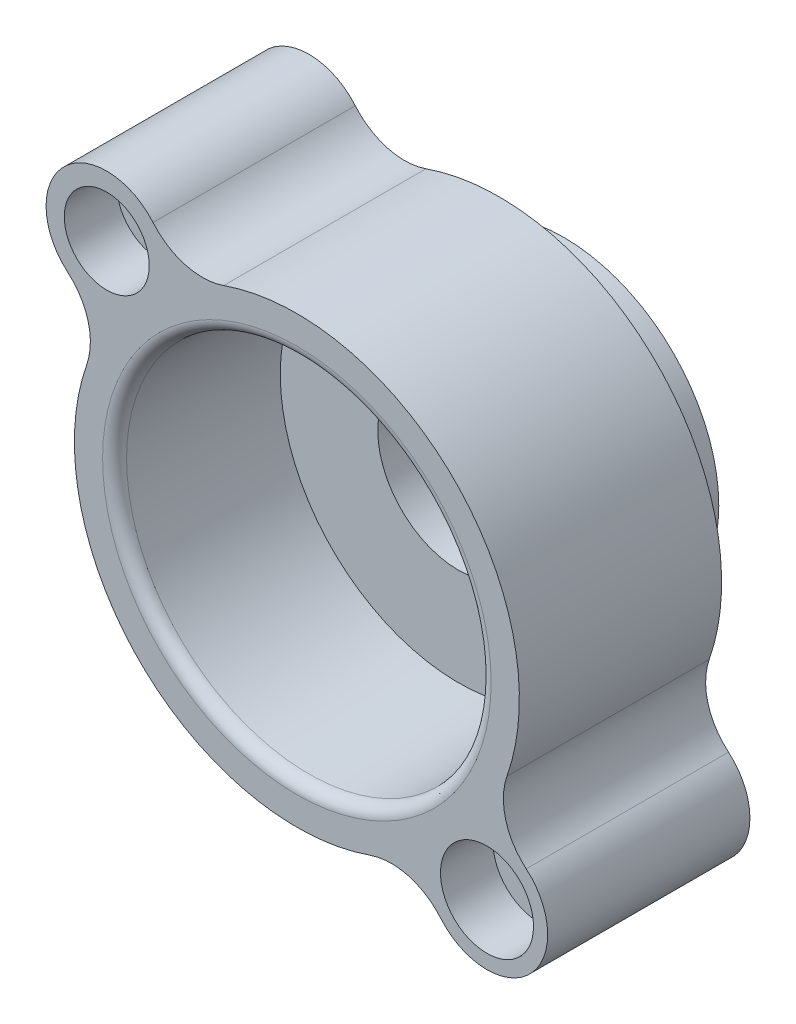
ISO-10303-21;
HEADER;
FILE_DESCRIPTION(('STEP AP214'),'2;1');
FILE_NAME('part.step','',(''),(''),'','','');
FILE_SCHEMA(('AUTOMOTIVE_DESIGN { 1 0 10303 214 1 1 1 1 }'));
ENDSEC;
DATA;
#1=APPLICATION_CONTEXT('core data for automotive mechanical design processes');
#2=APPLICATION_PROTOCOL_DEFINITION('international standard','automotive_design',2000,#1);
#3=PRODUCT_CONTEXT('',#1,'mechanical');
#4=PRODUCT('Part','Part','',(#3));
#5=PRODUCT_RELATED_PRODUCT_CATEGORY('part','',(#4));
#6=PRODUCT_DEFINITION_FORMATION('','',#4);
#7=PRODUCT_DEFINITION_CONTEXT('part definition',#1,'design');
#8=PRODUCT_DEFINITION('design','',#6,#7);
#9=PRODUCT_DEFINITION_SHAPE('','',#8);
#10=(LENGTH_UNIT() NAMED_UNIT(*) SI_UNIT(.MILLI.,.METRE.));
#11=(NAMED_UNIT(*) PLANE_ANGLE_UNIT() SI_UNIT($,.RADIAN.));
#12=(NAMED_UNIT(*) SI_UNIT($,.STERADIAN.) SOLID_ANGLE_UNIT());
#13=UNCERTAINTY_MEASURE_WITH_UNIT(LENGTH_MEASURE(1.E-05),#10,'distance_accuracy_value','');
#14=(GEOMETRIC_REPRESENTATION_CONTEXT(3) GLOBAL_UNCERTAINTY_ASSIGNED_CONTEXT((#13)) GLOBAL_UNIT_ASSIGNED_CONTEXT((#10,
#11,#12)) REPRESENTATION_CONTEXT('',''));
#15=CARTESIAN_POINT('',(0.,0.,0.));
#16=DIRECTION('',(0.,0.,1.));
#17=DIRECTION('',(1.,0.,0.));
#18=AXIS2_PLACEMENT_3D('',#15,#16,#17);
#19=CARTESIAN_POINT('',(-148.308512816503,425.758508459999,203.2));
#20=DIRECTION('',(0.,0.,1.));
#21=DIRECTION('',(1.,0.,0.));
#22=AXIS2_PLACEMENT_3D('',#19,#20,#21);
#23=PLANE('',#22);
#24=CARTESIAN_POINT('',(-596.9,596.9,203.2));
#25=DIRECTION('',(0.,0.,1.));
#26=DIRECTION('',(1.,0.,0.));
#27=AXIS2_PLACEMENT_3D('',#24,#25,#26);
#28=CIRCLE('',#27,69.85);
#29=CARTESIAN_POINT('',(-527.05,596.9,203.2));
#30=VERTEX_POINT('',#29);
#31=EDGE_CURVE('E176',#30,#30,#28,.T.);
#32=ORIENTED_EDGE('',*,*,#31,.T.);
#33=EDGE_LOOP('',(#32));
#34=FACE_BOUND('',#33,.T.);
#35=CARTESIAN_POINT('',(596.9,-596.9,203.2));
#36=DIRECTION('',(0.,0.,1.));
#37=DIRECTION('',(1.,0.,0.));
#38=AXIS2_PLACEMENT_3D('',#35,#36,#37);
#39=CIRCLE('',#38,69.85);
#40=CARTESIAN_POINT('',(666.75,-596.9,203.2));
#41=VERTEX_POINT('',#40);
#42=EDGE_CURVE('E171',#41,#41,#39,.T.);
#43=ORIENTED_EDGE('',*,*,#42,.T.);
#44=EDGE_LOOP('',(#43));
#45=FACE_BOUND('',#44,.T.);
#46=CARTESIAN_POINT('',(-1.57651669496772E-11,-8.62643290133747E-11,203.2));
#47=DIRECTION('',(0.,0.,1.));
#48=DIRECTION('',(1.,0.,0.));
#49=AXIS2_PLACEMENT_3D('',#46,#47,#48);
#50=CIRCLE('',#49,698.499999999974);
#51=CARTESIAN_POINT('',(659.625858177572,-229.773752250957,203.2));
#52=VERTEX_POINT('',#51);
#53=CARTESIAN_POINT('',(-229.773752250906,659.625858177495,203.2));
#54=VERTEX_POINT('',#53);
#55=EDGE_CURVE('E157',#52,#54,#50,.T.);
#56=ORIENTED_EDGE('',*,*,#55,.F.);
#57=CARTESIAN_POINT('',(851.517016920151,-296.617025633031,203.2));
#58=DIRECTION('',(0.,0.,-1.));
#59=DIRECTION('',(-1.,0.,0.));
#60=AXIS2_PLACEMENT_3D('',#57,#58,#59);
#61=CIRCLE('',#60,203.200000000001);
#62=CARTESIAN_POINT('',(720.101782380515,-451.601786596465,203.2));
#63=VERTEX_POINT('',#62);
#64=EDGE_CURVE('E125',#63,#52,#61,.T.);
#65=ORIENTED_EDGE('',*,*,#64,.F.);
#66=CARTESIAN_POINT('',(596.899999999598,-596.899999999694,203.2));
#67=DIRECTION('',(0.,0.,1.));
#68=DIRECTION('',(1.,0.,0.));
#69=AXIS2_PLACEMENT_3D('',#66,#67,#68);
#70=CIRCLE('',#69,190.500000000014);
#71=CARTESIAN_POINT('',(451.601786596373,-720.101782380616,203.2));
#72=VERTEX_POINT('',#71);
#73=EDGE_CURVE('E110',#72,#63,#70,.T.);
#74=ORIENTED_EDGE('',*,*,#73,.F.);
#75=CARTESIAN_POINT('',(296.617025632933,-851.517016920266,203.2));
#76=DIRECTION('',(0.,0.,-1.));
#77=DIRECTION('',(-1.,0.,0.));
#78=AXIS2_PLACEMENT_3D('',#75,#76,#77);
#79=CIRCLE('',#78,203.200000000014);
#80=CARTESIAN_POINT('',(229.773752250855,-659.625858177674,203.2));
#81=VERTEX_POINT('',#80);
#82=EDGE_CURVE('E123',#81,#72,#79,.T.);
#83=ORIENTED_EDGE('',*,*,#82,.F.);
#84=CARTESIAN_POINT('',(-1.57651669496772E-11,-8.62643290133747E-11,203.2));
#85=DIRECTION('',(0.,0.,1.));
#86=DIRECTION('',(1.,0.,0.));
#87=AXIS2_PLACEMENT_3D('',#84,#85,#86);
#88=CIRCLE('',#87,698.499999999974);
#89=CARTESIAN_POINT('',(-659.625858177582,229.773752250848,203.2));
#90=VERTEX_POINT('',#89);
#91=EDGE_CURVE('E128',#90,#81,#88,.T.);
#92=ORIENTED_EDGE('',*,*,#91,.F.);
#93=CARTESIAN_POINT('',(-851.517016920142,296.617025632936,203.2));
#94=DIRECTION('',(0.,0.,-1.));
#95=DIRECTION('',(-1.,0.,0.));
#96=AXIS2_PLACEMENT_3D('',#93,#94,#95);
#97=CIRCLE('',#96,203.199999999988);
#98=CARTESIAN_POINT('',(-720.10178238074,451.601786596551,203.2));
#99=VERTEX_POINT('',#98);
#100=EDGE_CURVE('E130',#99,#90,#97,.T.);
#101=ORIENTED_EDGE('',*,*,#100,.F.);
#102=CARTESIAN_POINT('',(-596.900000000034,596.89999999996,203.2));
#103=DIRECTION('',(0.,0.,1.));
#104=DIRECTION('',(1.,0.,0.));
#105=AXIS2_PLACEMENT_3D('',#102,#103,#104);
#106=CIRCLE('',#105,190.500000000014);
#107=CARTESIAN_POINT('',(-451.601786596626,720.101782380665,203.2));
#108=VERTEX_POINT('',#107);
#109=EDGE_CURVE('E239',#108,#99,#106,.T.);
#110=ORIENTED_EDGE('',*,*,#109,.F.);
#111=CARTESIAN_POINT('',(-296.61702563299,851.517016920085,203.2));
#112=DIRECTION('',(0.,0.,-1.));
#113=DIRECTION('',(-1.,0.,0.));
#114=AXIS2_PLACEMENT_3D('',#111,#112,#113);
#115=CIRCLE('',#114,203.200000000014);
#116=EDGE_CURVE('E237',#54,#108,#115,.T.);
#117=ORIENTED_EDGE('',*,*,#116,.F.);
#118=EDGE_LOOP('',(#56,#65,#74,#83,#92,#101,#110,#117));
#119=FACE_BOUND('',#118,.T.);
#120=CARTESIAN_POINT('',(0.,0.,203.2));
#121=DIRECTION('',(0.,0.,1.));
#122=DIRECTION('',(1.,0.,0.));
#123=AXIS2_PLACEMENT_3D('',#120,#121,#122);
#124=CIRCLE('',#123,486.41);
#125=CARTESIAN_POINT('',(486.41,0.,203.2));
#126=VERTEX_POINT('',#125);
#127=EDGE_CURVE('E159',#126,#126,#124,.F.);
#128=ORIENTED_EDGE('',*,*,#127,.F.);
#129=EDGE_LOOP('',(#128));
#130=FACE_BOUND('',#129,.T.);
#131=ADVANCED_FACE('F35',(#34,#45,#119,#130),#23,.F.);
#132=CARTESIAN_POINT('',(-1.57651669496772E-11,-8.62643290133747E-11,203.2));
#133=DIRECTION('',(0.,0.,1.));
#134=DIRECTION('',(1.,0.,0.));
#135=AXIS2_PLACEMENT_3D('',#132,#133,#134);
#136=CYLINDRICAL_SURFACE('',#135,698.499999999974);
#137=CARTESIAN_POINT('',(-1.57651669496772E-11,-8.62643290133747E-11,838.2));
#138=DIRECTION('',(0.,0.,1.));
#139=DIRECTION('',(1.,0.,0.));
#140=AXIS2_PLACEMENT_3D('',#137,#138,#139);
#141=CIRCLE('',#140,698.499999999974);
#142=CARTESIAN_POINT('',(659.625858177572,-229.773752250957,838.2));
#143=VERTEX_POINT('',#142);
#144=CARTESIAN_POINT('',(-229.773752250906,659.625858177495,838.2));
#145=VERTEX_POINT('',#144);
#146=EDGE_CURVE('E135',#143,#145,#141,.T.);
#147=ORIENTED_EDGE('',*,*,#146,.F.);
#148=DIRECTION('',(0.,0.,1.));
#149=VECTOR('',#148,1.);
#150=CARTESIAN_POINT('',(659.625858177572,-229.773752250957,203.2));
#151=LINE('',#150,#149);
#152=EDGE_CURVE('E52',#52,#143,#151,.T.);
#153=ORIENTED_EDGE('',*,*,#152,.F.);
#154=ORIENTED_EDGE('',*,*,#55,.T.);
#155=DIRECTION('',(0.,0.,1.));
#156=VECTOR('',#155,1.);
#157=CARTESIAN_POINT('',(-229.773752250906,659.625858177495,203.2));
#158=LINE('',#157,#156);
#159=EDGE_CURVE('E93',#54,#145,#158,.T.);
#160=ORIENTED_EDGE('',*,*,#159,.T.);
#161=EDGE_LOOP('',(#147,#153,#154,#160));
#162=FACE_BOUND('',#161,.T.);
#163=ADVANCED_FACE('F197',(#162),#136,.T.);
#164=CARTESIAN_POINT('',(851.517016920151,-296.617025633031,203.2));
#165=DIRECTION('',(0.,0.,1.));
#166=DIRECTION('',(1.,0.,0.));
#167=AXIS2_PLACEMENT_3D('',#164,#165,#166);
#168=CYLINDRICAL_SURFACE('',#167,203.200000000001);
#169=CARTESIAN_POINT('',(851.517016920151,-296.617025633031,838.2));
#170=DIRECTION('',(0.,0.,-1.));
#171=DIRECTION('',(-1.,0.,0.));
#172=AXIS2_PLACEMENT_3D('',#169,#170,#171);
#173=CIRCLE('',#172,203.200000000001);
#174=CARTESIAN_POINT('',(720.101782380515,-451.601786596465,838.2));
#175=VERTEX_POINT('',#174);
#176=EDGE_CURVE('E154',#175,#143,#173,.T.);
#177=ORIENTED_EDGE('',*,*,#176,.F.);
#178=DIRECTION('',(0.,0.,1.));
#179=VECTOR('',#178,1.);
#180=CARTESIAN_POINT('',(720.101782380515,-451.601786596465,203.2));
#181=LINE('',#180,#179);
#182=EDGE_CURVE('E81',#63,#175,#181,.T.);
#183=ORIENTED_EDGE('',*,*,#182,.F.);
#184=ORIENTED_EDGE('',*,*,#64,.T.);
#185=ORIENTED_EDGE('',*,*,#152,.T.);
#186=EDGE_LOOP('',(#177,#183,#184,#185));
#187=FACE_BOUND('',#186,.T.);
#188=ADVANCED_FACE('F203',(#187),#168,.F.);
#189=CARTESIAN_POINT('',(596.899999999598,-596.899999999694,203.2));
#190=DIRECTION('',(0.,0.,1.));
#191=DIRECTION('',(1.,0.,0.));
#192=AXIS2_PLACEMENT_3D('',#189,#190,#191);
#193=CYLINDRICAL_SURFACE('',#192,190.500000000014);
#194=CARTESIAN_POINT('',(596.899999999598,-596.899999999694,838.2));
#195=DIRECTION('',(0.,0.,1.));
#196=DIRECTION('',(1.,0.,0.));
#197=AXIS2_PLACEMENT_3D('',#194,#195,#196);
#198=CIRCLE('',#197,190.500000000014);
#199=CARTESIAN_POINT('',(451.601786596373,-720.101782380616,838.2));
#200=VERTEX_POINT('',#199);
#201=EDGE_CURVE('E112',#200,#175,#198,.T.);
#202=ORIENTED_EDGE('',*,*,#201,.F.);
#203=DIRECTION('',(0.,0.,1.));
#204=VECTOR('',#203,1.);
#205=CARTESIAN_POINT('',(451.601786596373,-720.101782380616,203.2));
#206=LINE('',#205,#204);
#207=EDGE_CURVE('E107',#72,#200,#206,.T.);
#208=ORIENTED_EDGE('',*,*,#207,.F.);
#209=ORIENTED_EDGE('',*,*,#73,.T.);
#210=ORIENTED_EDGE('',*,*,#182,.T.);
#211=EDGE_LOOP('',(#202,#208,#209,#210));
#212=FACE_BOUND('',#211,.T.);
#213=ADVANCED_FACE('F109',(#212),#193,.T.);
#214=CARTESIAN_POINT('',(296.617025632933,-851.517016920266,203.2));
#215=DIRECTION('',(0.,0.,1.));
#216=DIRECTION('',(1.,0.,0.));
#217=AXIS2_PLACEMENT_3D('',#214,#215,#216);
#218=CYLINDRICAL_SURFACE('',#217,203.200000000014);
#219=CARTESIAN_POINT('',(296.617025632933,-851.517016920266,838.2));
#220=DIRECTION('',(0.,0.,-1.));
#221=DIRECTION('',(-1.,0.,0.));
#222=AXIS2_PLACEMENT_3D('',#219,#220,#221);
#223=CIRCLE('',#222,203.200000000014);
#224=CARTESIAN_POINT('',(229.773752250855,-659.625858177674,838.2));
#225=VERTEX_POINT('',#224);
#226=EDGE_CURVE('E151',#225,#200,#223,.T.);
#227=ORIENTED_EDGE('',*,*,#226,.F.);
#228=DIRECTION('',(0.,0.,1.));
#229=VECTOR('',#228,1.);
#230=CARTESIAN_POINT('',(229.773752250855,-659.625858177674,203.2));
#231=LINE('',#230,#229);
#232=EDGE_CURVE('E117',#81,#225,#231,.T.);
#233=ORIENTED_EDGE('',*,*,#232,.F.);
#234=ORIENTED_EDGE('',*,*,#82,.T.);
#235=ORIENTED_EDGE('',*,*,#207,.T.);
#236=EDGE_LOOP('',(#227,#233,#234,#235));
#237=FACE_BOUND('',#236,.T.);
#238=ADVANCED_FACE('F127',(#237),#218,.F.);
#239=CARTESIAN_POINT('',(-1.57651669496772E-11,-8.62643290133747E-11,203.2));
#240=DIRECTION('',(0.,0.,1.));
#241=DIRECTION('',(1.,0.,0.));
#242=AXIS2_PLACEMENT_3D('',#239,#240,#241);
#243=CYLINDRICAL_SURFACE('',#242,698.499999999974);
#244=CARTESIAN_POINT('',(-1.57651669496772E-11,-8.62643290133747E-11,838.2));
#245=DIRECTION('',(0.,0.,1.));
#246=DIRECTION('',(1.,0.,0.));
#247=AXIS2_PLACEMENT_3D('',#244,#245,#246);
#248=CIRCLE('',#247,698.499999999974);
#249=CARTESIAN_POINT('',(-659.625858177582,229.773752250848,838.2));
#250=VERTEX_POINT('',#249);
#251=EDGE_CURVE('E148',#250,#225,#248,.T.);
#252=ORIENTED_EDGE('',*,*,#251,.F.);
#253=DIRECTION('',(0.,0.,1.));
#254=VECTOR('',#253,1.);
#255=CARTESIAN_POINT('',(-659.625858177582,229.773752250848,203.2));
#256=LINE('',#255,#254);
#257=EDGE_CURVE('E162',#90,#250,#256,.T.);
#258=ORIENTED_EDGE('',*,*,#257,.F.);
#259=ORIENTED_EDGE('',*,*,#91,.T.);
#260=ORIENTED_EDGE('',*,*,#232,.T.);
#261=EDGE_LOOP('',(#252,#258,#259,#260));
#262=FACE_BOUND('',#261,.T.);
#263=ADVANCED_FACE('F220',(#262),#243,.T.);
#264=CARTESIAN_POINT('',(-851.517016920142,296.617025632936,203.2));
#265=DIRECTION('',(0.,0.,1.));
#266=DIRECTION('',(1.,0.,0.));
#267=AXIS2_PLACEMENT_3D('',#264,#265,#266);
#268=CYLINDRICAL_SURFACE('',#267,203.199999999988);
#269=CARTESIAN_POINT('',(-851.517016920142,296.617025632936,838.2));
#270=DIRECTION('',(0.,0.,-1.));
#271=DIRECTION('',(-1.,0.,0.));
#272=AXIS2_PLACEMENT_3D('',#269,#270,#271);
#273=CIRCLE('',#272,203.199999999988);
#274=CARTESIAN_POINT('',(-720.10178238074,451.601786596551,838.2));
#275=VERTEX_POINT('',#274);
#276=EDGE_CURVE('E145',#275,#250,#273,.T.);
#277=ORIENTED_EDGE('',*,*,#276,.F.);
#278=DIRECTION('',(0.,0.,1.));
#279=VECTOR('',#278,1.);
#280=CARTESIAN_POINT('',(-720.10178238074,451.601786596551,203.2));
#281=LINE('',#280,#279);
#282=EDGE_CURVE('E164',#99,#275,#281,.T.);
#283=ORIENTED_EDGE('',*,*,#282,.F.);
#284=ORIENTED_EDGE('',*,*,#100,.T.);
#285=ORIENTED_EDGE('',*,*,#257,.T.);
#286=EDGE_LOOP('',(#277,#283,#284,#285));
#287=FACE_BOUND('',#286,.T.);
#288=ADVANCED_FACE('F223',(#287),#268,.F.);
#289=CARTESIAN_POINT('',(-596.900000000034,596.89999999996,203.2));
#290=DIRECTION('',(0.,0.,1.));
#291=DIRECTION('',(1.,0.,0.));
#292=AXIS2_PLACEMENT_3D('',#289,#290,#291);
#293=CYLINDRICAL_SURFACE('',#292,190.500000000014);
#294=CARTESIAN_POINT('',(-596.900000000034,596.89999999996,838.2));
#295=DIRECTION('',(0.,0.,1.));
#296=DIRECTION('',(1.,0.,0.));
#297=AXIS2_PLACEMENT_3D('',#294,#295,#296);
#298=CIRCLE('',#297,190.500000000014);
#299=CARTESIAN_POINT('',(-451.601786596626,720.101782380665,838.2));
#300=VERTEX_POINT('',#299);
#301=EDGE_CURVE('E142',#300,#275,#298,.T.);
#302=ORIENTED_EDGE('',*,*,#301,.F.);
#303=DIRECTION('',(0.,0.,1.));
#304=VECTOR('',#303,1.);
#305=CARTESIAN_POINT('',(-451.601786596626,720.101782380665,203.2));
#306=LINE('',#305,#304);
#307=EDGE_CURVE('E166',#108,#300,#306,.T.);
#308=ORIENTED_EDGE('',*,*,#307,.F.);
#309=ORIENTED_EDGE('',*,*,#109,.T.);
#310=ORIENTED_EDGE('',*,*,#282,.T.);
#311=EDGE_LOOP('',(#302,#308,#309,#310));
#312=FACE_BOUND('',#311,.T.);
#313=ADVANCED_FACE('F227',(#312),#293,.T.);
#314=CARTESIAN_POINT('',(-296.61702563299,851.517016920085,203.2));
#315=DIRECTION('',(0.,0.,1.));
#316=DIRECTION('',(1.,0.,0.));
#317=AXIS2_PLACEMENT_3D('',#314,#315,#316);
#318=CYLINDRICAL_SURFACE('',#317,203.200000000014);
#319=CARTESIAN_POINT('',(-296.61702563299,851.517016920085,838.2));
#320=DIRECTION('',(0.,0.,-1.));
#321=DIRECTION('',(-1.,0.,0.));
#322=AXIS2_PLACEMENT_3D('',#319,#320,#321);
#323=CIRCLE('',#322,203.200000000014);
#324=EDGE_CURVE('E138',#145,#300,#323,.T.);
#325=ORIENTED_EDGE('',*,*,#324,.F.);
#326=ORIENTED_EDGE('',*,*,#159,.F.);
#327=ORIENTED_EDGE('',*,*,#116,.T.);
#328=ORIENTED_EDGE('',*,*,#307,.T.);
#329=EDGE_LOOP('',(#325,#326,#327,#328));
#330=FACE_BOUND('',#329,.T.);
#331=ADVANCED_FACE('F212',(#330),#318,.F.);
#332=CARTESIAN_POINT('',(-148.308512816503,425.758508459999,838.2));
#333=DIRECTION('',(0.,0.,1.));
#334=DIRECTION('',(1.,0.,0.));
#335=AXIS2_PLACEMENT_3D('',#332,#333,#334);
#336=PLANE('',#335);
#337=CARTESIAN_POINT('',(0.,0.,838.2));
#338=DIRECTION('',(0.,0.,1.));
#339=DIRECTION('',(1.,0.,0.));
#340=AXIS2_PLACEMENT_3D('',#337,#338,#339);
#341=CIRCLE('',#340,609.929404390122);
#342=CARTESIAN_POINT('',(609.929404390122,0.,838.2));
#343=VERTEX_POINT('',#342);
#344=EDGE_CURVE('E11',#343,#343,#341,.F.);
#345=ORIENTED_EDGE('',*,*,#344,.T.);
#346=EDGE_LOOP('',(#345));
#347=FACE_BOUND('',#346,.T.);
#348=CARTESIAN_POINT('',(-596.9,596.9,838.2));
#349=DIRECTION('',(0.,0.,1.));
#350=DIRECTION('',(1.,0.,0.));
#351=AXIS2_PLACEMENT_3D('',#348,#349,#350);
#352=CIRCLE('',#351,133.35);
#353=CARTESIAN_POINT('',(-463.55,596.9,838.2));
#354=VERTEX_POINT('',#353);
#355=EDGE_CURVE('E271',#354,#354,#352,.T.);
#356=ORIENTED_EDGE('',*,*,#355,.F.);
#357=EDGE_LOOP('',(#356));
#358=FACE_BOUND('',#357,.T.);
#359=CARTESIAN_POINT('',(596.9,-596.9,838.2));
#360=DIRECTION('',(0.,0.,1.));
#361=DIRECTION('',(1.,0.,0.));
#362=AXIS2_PLACEMENT_3D('',#359,#360,#361);
#363=CIRCLE('',#362,146.05);
#364=CARTESIAN_POINT('',(742.95,-596.9,838.2));
#365=VERTEX_POINT('',#364);
#366=EDGE_CURVE('E178',#365,#365,#363,.T.);
#367=ORIENTED_EDGE('',*,*,#366,.F.);
#368=EDGE_LOOP('',(#367));
#369=FACE_BOUND('',#368,.T.);
#370=ORIENTED_EDGE('',*,*,#146,.T.);
#371=ORIENTED_EDGE('',*,*,#324,.T.);
#372=ORIENTED_EDGE('',*,*,#301,.T.);
#373=ORIENTED_EDGE('',*,*,#276,.T.);
#374=ORIENTED_EDGE('',*,*,#251,.T.);
#375=ORIENTED_EDGE('',*,*,#226,.T.);
#376=ORIENTED_EDGE('',*,*,#201,.T.);
#377=ORIENTED_EDGE('',*,*,#176,.T.);
#378=EDGE_LOOP('',(#370,#371,#372,#373,#374,#375,#376,#377));
#379=FACE_BOUND('',#378,.T.);
#380=ADVANCED_FACE('F209',(#347,#358,#369,#379),#336,.T.);
#381=CARTESIAN_POINT('',(0.,0.,1.66533453693773E-13));
#382=DIRECTION('',(0.,0.,1.));
#383=DIRECTION('',(1.,0.,0.));
#384=AXIS2_PLACEMENT_3D('',#381,#382,#383);
#385=CYLINDRICAL_SURFACE('',#384,486.41);
#386=CARTESIAN_POINT('',(0.,0.,1.66533453693773E-13));
#387=DIRECTION('',(0.,0.,-1.));
#388=DIRECTION('',(-1.,0.,0.));
#389=AXIS2_PLACEMENT_3D('',#386,#387,#388);
#390=CIRCLE('',#389,486.41);
#391=CARTESIAN_POINT('',(-486.41,0.,1.66533453693773E-13));
#392=VERTEX_POINT('',#391);
#393=EDGE_CURVE('E139',#392,#392,#390,.T.);
#394=ORIENTED_EDGE('',*,*,#393,.F.);
#395=EDGE_LOOP('',(#394));
#396=FACE_BOUND('',#395,.T.);
#397=ORIENTED_EDGE('',*,*,#127,.T.);
#398=EDGE_LOOP('',(#397));
#399=FACE_BOUND('',#398,.T.);
#400=ADVANCED_FACE('F207',(#396,#399),#385,.T.);
#401=CARTESIAN_POINT('',(0.,0.,1.66533453693773E-13));
#402=DIRECTION('',(0.,0.,-1.));
#403=DIRECTION('',(-1.,0.,0.));
#404=AXIS2_PLACEMENT_3D('',#401,#402,#403);
#405=PLANE('',#404);
#406=CARTESIAN_POINT('',(0.,0.,1.66533453693773E-13));
#407=DIRECTION('',(0.,0.,1.));
#408=DIRECTION('',(-1.,0.,0.));
#409=AXIS2_PLACEMENT_3D('',#406,#407,#408);
#410=CIRCLE('',#409,254.);
#411=CARTESIAN_POINT('',(-254.,0.,1.66533453693773E-13));
#412=VERTEX_POINT('',#411);
#413=EDGE_CURVE('E254',#412,#412,#410,.T.);
#414=ORIENTED_EDGE('',*,*,#413,.T.);
#415=EDGE_LOOP('',(#414));
#416=FACE_BOUND('',#415,.T.);
#417=ORIENTED_EDGE('',*,*,#393,.T.);
#418=EDGE_LOOP('',(#417));
#419=FACE_BOUND('',#418,.T.);
#420=ADVANCED_FACE('F309',(#416,#419),#405,.T.);
#421=CARTESIAN_POINT('',(0.,0.,838.2));
#422=DIRECTION('',(0.,0.,1.));
#423=DIRECTION('',(-1.,0.,0.));
#424=AXIS2_PLACEMENT_3D('',#421,#422,#423);
#425=CONICAL_SURFACE('',#424,572.769999999892,0.0249947936189181);
#426=CARTESIAN_POINT('',(0.,0.,801.052202483204));
#427=DIRECTION('',(0.,0.,1.));
#428=DIRECTION('',(1.,0.,0.));
#429=AXIS2_PLACEMENT_3D('',#426,#427,#428);
#430=CIRCLE('',#429,571.841305061973);
#431=CARTESIAN_POINT('',(571.841305061973,0.,801.052202483204));
#432=VERTEX_POINT('',#431);
#433=EDGE_CURVE('E44',#432,#432,#430,.T.);
#434=ORIENTED_EDGE('',*,*,#433,.T.);
#435=EDGE_LOOP('',(#434));
#436=FACE_BOUND('',#435,.T.);
#437=CARTESIAN_POINT('',(0.,0.,330.200000000002));
#438=DIRECTION('',(0.,0.,-1.));
#439=DIRECTION('',(-1.,0.,0.));
#440=AXIS2_PLACEMENT_3D('',#437,#438,#439);
#441=CIRCLE('',#440,560.069999999894);
#442=CARTESIAN_POINT('',(-560.069999999894,0.,330.200000000002));
#443=VERTEX_POINT('',#442);
#444=EDGE_CURVE('E251',#443,#443,#441,.F.);
#445=ORIENTED_EDGE('',*,*,#444,.F.);
#446=EDGE_LOOP('',(#445));
#447=FACE_BOUND('',#446,.T.);
#448=ADVANCED_FACE('F183',(#436,#447),#425,.F.);
#449=CARTESIAN_POINT('',(0.,0.,330.200000000002));
#450=DIRECTION('',(0.,0.,-1.));
#451=DIRECTION('',(-1.,0.,0.));
#452=AXIS2_PLACEMENT_3D('',#449,#450,#451);
#453=PLANE('',#452);
#454=CARTESIAN_POINT('',(0.,0.,330.200000000002));
#455=DIRECTION('',(0.,0.,1.));
#456=DIRECTION('',(-1.,0.,0.));
#457=AXIS2_PLACEMENT_3D('',#454,#455,#456);
#458=CIRCLE('',#457,254.);
#459=CARTESIAN_POINT('',(-254.,0.,330.200000000002));
#460=VERTEX_POINT('',#459);
#461=EDGE_CURVE('E174',#460,#460,#458,.T.);
#462=ORIENTED_EDGE('',*,*,#461,.F.);
#463=EDGE_LOOP('',(#462));
#464=FACE_BOUND('',#463,.T.);
#465=ORIENTED_EDGE('',*,*,#444,.T.);
#466=EDGE_LOOP('',(#465));
#467=FACE_BOUND('',#466,.T.);
#468=ADVANCED_FACE('F303',(#464,#467),#453,.F.);
#469=CARTESIAN_POINT('',(0.,0.,1.66533453693773E-13));
#470=DIRECTION('',(0.,0.,1.));
#471=DIRECTION('',(1.,0.,0.));
#472=AXIS2_PLACEMENT_3D('',#469,#470,#471);
#473=CYLINDRICAL_SURFACE('',#472,254.);
#474=ORIENTED_EDGE('',*,*,#413,.F.);
#475=EDGE_LOOP('',(#474));
#476=FACE_BOUND('',#475,.T.);
#477=ORIENTED_EDGE('',*,*,#461,.T.);
#478=EDGE_LOOP('',(#477));
#479=FACE_BOUND('',#478,.T.);
#480=ADVANCED_FACE('F299',(#476,#479),#473,.F.);
#481=CARTESIAN_POINT('',(596.9,-596.9,838.2));
#482=DIRECTION('',(0.,0.,1.));
#483=DIRECTION('',(1.,0.,0.));
#484=AXIS2_PLACEMENT_3D('',#481,#482,#483);
#485=CYLINDRICAL_SURFACE('',#484,69.85);
#486=CARTESIAN_POINT('',(596.9,-596.9,673.1));
#487=DIRECTION('',(0.,0.,1.));
#488=DIRECTION('',(1.,0.,0.));
#489=AXIS2_PLACEMENT_3D('',#486,#487,#488);
#490=CIRCLE('',#489,69.85);
#491=CARTESIAN_POINT('',(666.75,-596.9,673.1));
#492=VERTEX_POINT('',#491);
#493=EDGE_CURVE('E175',#492,#492,#490,.T.);
#494=ORIENTED_EDGE('',*,*,#493,.T.);
#495=EDGE_LOOP('',(#494));
#496=FACE_BOUND('',#495,.T.);
#497=ORIENTED_EDGE('',*,*,#42,.F.);
#498=EDGE_LOOP('',(#497));
#499=FACE_BOUND('',#498,.T.);
#500=ADVANCED_FACE('F291',(#496,#499),#485,.F.);
#501=CARTESIAN_POINT('',(666.75,-596.9,673.1));
#502=DIRECTION('',(0.,0.,-1.));
#503=DIRECTION('',(-1.,0.,0.));
#504=AXIS2_PLACEMENT_3D('',#501,#502,#503);
#505=PLANE('',#504);
#506=ORIENTED_EDGE('',*,*,#493,.F.);
#507=EDGE_LOOP('',(#506));
#508=FACE_BOUND('',#507,.T.);
#509=CARTESIAN_POINT('',(596.9,-596.9,673.1));
#510=DIRECTION('',(0.,0.,1.));
#511=DIRECTION('',(1.,0.,0.));
#512=AXIS2_PLACEMENT_3D('',#509,#510,#511);
#513=CIRCLE('',#512,146.05);
#514=CARTESIAN_POINT('',(742.95,-596.9,673.1));
#515=VERTEX_POINT('',#514);
#516=EDGE_CURVE('E261',#515,#515,#513,.T.);
#517=ORIENTED_EDGE('',*,*,#516,.T.);
#518=EDGE_LOOP('',(#517));
#519=FACE_BOUND('',#518,.T.);
#520=ADVANCED_FACE('F282',(#508,#519),#505,.F.);
#521=CARTESIAN_POINT('',(596.9,-596.9,838.2));
#522=DIRECTION('',(0.,0.,1.));
#523=DIRECTION('',(1.,0.,0.));
#524=AXIS2_PLACEMENT_3D('',#521,#522,#523);
#525=CYLINDRICAL_SURFACE('',#524,146.05);
#526=ORIENTED_EDGE('',*,*,#516,.F.);
#527=EDGE_LOOP('',(#526));
#528=FACE_BOUND('',#527,.T.);
#529=ORIENTED_EDGE('',*,*,#366,.T.);
#530=EDGE_LOOP('',(#529));
#531=FACE_BOUND('',#530,.T.);
#532=ADVANCED_FACE('F279',(#528,#531),#525,.F.);
#533=CARTESIAN_POINT('',(-596.9,596.9,838.2));
#534=DIRECTION('',(0.,0.,1.));
#535=DIRECTION('',(1.,0.,0.));
#536=AXIS2_PLACEMENT_3D('',#533,#534,#535);
#537=CYLINDRICAL_SURFACE('',#536,69.85);
#538=CARTESIAN_POINT('',(-596.9,596.9,673.1));
#539=DIRECTION('',(0.,0.,1.));
#540=DIRECTION('',(1.,0.,0.));
#541=AXIS2_PLACEMENT_3D('',#538,#539,#540);
#542=CIRCLE('',#541,69.85);
#543=CARTESIAN_POINT('',(-527.05,596.9,673.1));
#544=VERTEX_POINT('',#543);
#545=EDGE_CURVE('E179',#544,#544,#542,.T.);
#546=ORIENTED_EDGE('',*,*,#545,.T.);
#547=EDGE_LOOP('',(#546));
#548=FACE_BOUND('',#547,.T.);
#549=ORIENTED_EDGE('',*,*,#31,.F.);
#550=EDGE_LOOP('',(#549));
#551=FACE_BOUND('',#550,.T.);
#552=ADVANCED_FACE('F281',(#548,#551),#537,.F.);
#553=CARTESIAN_POINT('',(-527.05,596.9,673.1));
#554=DIRECTION('',(0.,0.,-1.));
#555=DIRECTION('',(-1.,0.,0.));
#556=AXIS2_PLACEMENT_3D('',#553,#554,#555);
#557=PLANE('',#556);
#558=ORIENTED_EDGE('',*,*,#545,.F.);
#559=EDGE_LOOP('',(#558));
#560=FACE_BOUND('',#559,.T.);
#561=CARTESIAN_POINT('',(-596.9,596.9,673.1));
#562=DIRECTION('',(0.,0.,1.));
#563=DIRECTION('',(1.,0.,0.));
#564=AXIS2_PLACEMENT_3D('',#561,#562,#563);
#565=CIRCLE('',#564,133.35);
#566=CARTESIAN_POINT('',(-463.55,596.9,673.1));
#567=VERTEX_POINT('',#566);
#568=EDGE_CURVE('E268',#567,#567,#565,.T.);
#569=ORIENTED_EDGE('',*,*,#568,.T.);
#570=EDGE_LOOP('',(#569));
#571=FACE_BOUND('',#570,.T.);
#572=ADVANCED_FACE('F192',(#560,#571),#557,.F.);
#573=CARTESIAN_POINT('',(-596.9,596.9,838.2));
#574=DIRECTION('',(0.,0.,1.));
#575=DIRECTION('',(1.,0.,0.));
#576=AXIS2_PLACEMENT_3D('',#573,#574,#575);
#577=CYLINDRICAL_SURFACE('',#576,133.35);
#578=ORIENTED_EDGE('',*,*,#568,.F.);
#579=EDGE_LOOP('',(#578));
#580=FACE_BOUND('',#579,.T.);
#581=ORIENTED_EDGE('',*,*,#355,.T.);
#582=EDGE_LOOP('',(#581));
#583=FACE_BOUND('',#582,.T.);
#584=ADVANCED_FACE('F187',(#580,#583),#577,.F.);
#585=CARTESIAN_POINT('',(0.,0.,800.1));
#586=DIRECTION('',(0.,0.,1.));
#587=DIRECTION('',(1.,0.,0.));
#588=AXIS2_PLACEMENT_3D('',#585,#586,#587);
#589=TOROIDAL_SURFACE('',#588,609.929404390122,38.1);
#590=ORIENTED_EDGE('',*,*,#344,.F.);
#591=EDGE_LOOP('',(#590));
#592=FACE_BOUND('',#591,.T.);
#593=ORIENTED_EDGE('',*,*,#433,.F.);
#594=EDGE_LOOP('',(#593));
#595=FACE_BOUND('',#594,.T.);
#596=ADVANCED_FACE('F37',(#592,#595),#589,.T.);
#597=CLOSED_SHELL('',(#131,#163,#188,#213,#238,#263,#288,#313,#331,#380,#400,#420,#448,#468,
#480,#500,#520,#532,#552,#572,#584,#596));
#598=MANIFOLD_SOLID_BREP('B2',#597);
#599=ADVANCED_BREP_SHAPE_REPRESENTATION('',(#18,#598),#14);
#600=SHAPE_DEFINITION_REPRESENTATION(#9,#599);
ENDSEC;
END-ISO-10303-21;
